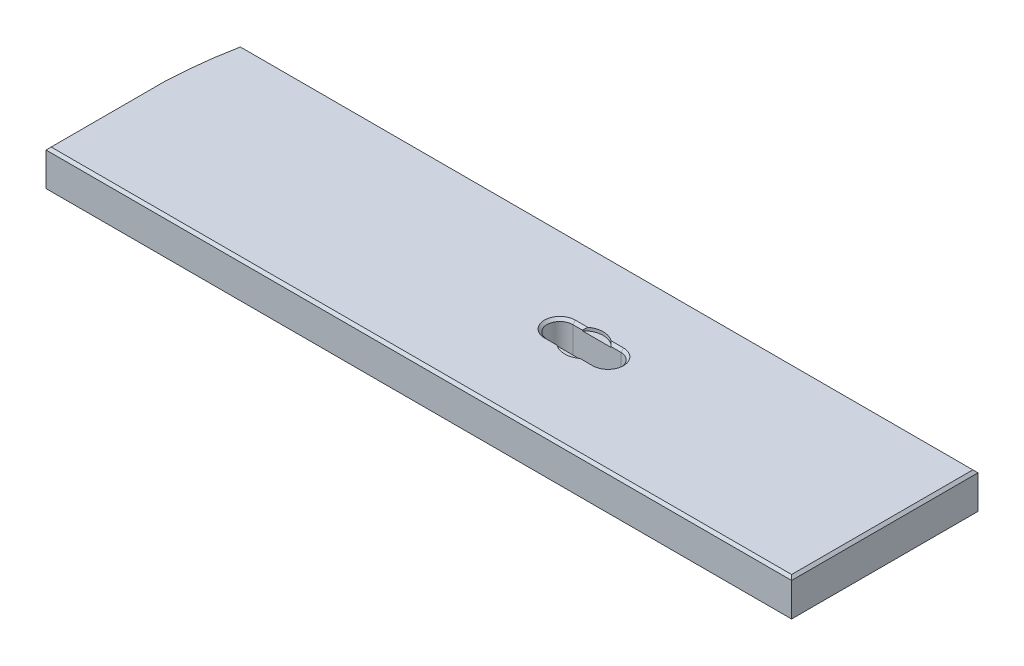
ISO-10303-21;
HEADER;
FILE_DESCRIPTION(('STEP AP214'),'2;1');
FILE_NAME('part.step','',(''),(''),'','','');
FILE_SCHEMA(('AUTOMOTIVE_DESIGN { 1 0 10303 214 1 1 1 1 }'));
ENDSEC;
DATA;
#1=APPLICATION_CONTEXT('core data for automotive mechanical design processes');
#2=APPLICATION_PROTOCOL_DEFINITION('international standard','automotive_design',2000,#1);
#3=PRODUCT_CONTEXT('',#1,'mechanical');
#4=PRODUCT('Part','Part','',(#3));
#5=PRODUCT_RELATED_PRODUCT_CATEGORY('part','',(#4));
#6=PRODUCT_DEFINITION_FORMATION('','',#4);
#7=PRODUCT_DEFINITION_CONTEXT('part definition',#1,'design');
#8=PRODUCT_DEFINITION('design','',#6,#7);
#9=PRODUCT_DEFINITION_SHAPE('','',#8);
#10=(LENGTH_UNIT() NAMED_UNIT(*) SI_UNIT(.MILLI.,.METRE.));
#11=(NAMED_UNIT(*) PLANE_ANGLE_UNIT() SI_UNIT($,.RADIAN.));
#12=(NAMED_UNIT(*) SI_UNIT($,.STERADIAN.) SOLID_ANGLE_UNIT());
#13=UNCERTAINTY_MEASURE_WITH_UNIT(LENGTH_MEASURE(1.E-05),#10,'distance_accuracy_value','');
#14=(GEOMETRIC_REPRESENTATION_CONTEXT(3) GLOBAL_UNCERTAINTY_ASSIGNED_CONTEXT((#13)) GLOBAL_UNIT_ASSIGNED_CONTEXT((#10,
#11,#12)) REPRESENTATION_CONTEXT('',''));
#15=CARTESIAN_POINT('',(0.,0.,0.));
#16=DIRECTION('',(0.,0.,1.));
#17=DIRECTION('',(1.,0.,0.));
#18=AXIS2_PLACEMENT_3D('',#15,#16,#17);
#19=CARTESIAN_POINT('',(409.5623,35.5599999999997,-85.43925));
#20=DIRECTION('',(0.,0.707106781186547,-0.707106781186549));
#21=DIRECTION('',(-1.,0.,0.));
#22=AXIS2_PLACEMENT_3D('',#19,#20,#21);
#23=PLANE('',#22);
#24=CARTESIAN_POINT('',(433.34305,22.8599999999997,-98.13925));
#25=DIRECTION('',(0.,0.707106781186547,-0.707106781186549));
#26=DIRECTION('',(0.,0.707106781186549,0.707106781186547));
#27=AXIS2_PLACEMENT_3D('',#24,#25,#26);
#28=ELLIPSE('',#27,26.9407683632075,19.05);
#29=CARTESIAN_POINT('',(444.77305,38.1,-82.8992499999997));
#30=VERTEX_POINT('',#29);
#31=CARTESIAN_POINT('',(447.542081657124,35.5599999999997,-85.43925));
#32=VERTEX_POINT('',#31);
#33=EDGE_CURVE('E206',#30,#32,#28,.T.);
#34=ORIENTED_EDGE('',*,*,#33,.F.);
#35=DIRECTION('',(-1.,0.,0.));
#36=VECTOR('',#35,1.);
#37=CARTESIAN_POINT('',(409.5623,38.1,-82.8992499999997));
#38=LINE('',#37,#36);
#39=CARTESIAN_POINT('',(457.1238,38.1,-82.8992499999997));
#40=VERTEX_POINT('',#39);
#41=EDGE_CURVE('E218',#40,#30,#38,.T.);
#42=ORIENTED_EDGE('',*,*,#41,.F.);
#43=DIRECTION('',(0.,0.707106781186549,0.707106781186547));
#44=VECTOR('',#43,1.);
#45=CARTESIAN_POINT('',(457.1238,35.5599999999997,-85.43925));
#46=LINE('',#45,#44);
#47=CARTESIAN_POINT('',(457.1238,35.5599999999997,-85.43925));
#48=VERTEX_POINT('',#47);
#49=EDGE_CURVE('E267',#48,#40,#46,.T.);
#50=ORIENTED_EDGE('',*,*,#49,.F.);
#51=DIRECTION('',(1.,0.,0.));
#52=VECTOR('',#51,1.);
#53=CARTESIAN_POINT('',(457.1238,35.5599999999997,-85.43925));
#54=LINE('',#53,#52);
#55=EDGE_CURVE('E220',#32,#48,#54,.T.);
#56=ORIENTED_EDGE('',*,*,#55,.F.);
#57=EDGE_LOOP('',(#34,#42,#50,#56));
#58=FACE_BOUND('',#57,.T.);
#59=ADVANCED_FACE('F41',(#58),#23,.T.);
#60=CARTESIAN_POINT('',(409.5623,35.5599999999997,-110.83925));
#61=DIRECTION('',(0.,0.707106781186547,0.707106781186549));
#62=DIRECTION('',(1.,0.,0.));
#63=AXIS2_PLACEMENT_3D('',#60,#61,#62);
#64=PLANE('',#63);
#65=CARTESIAN_POINT('',(433.34305,22.8599999999997,-98.13925));
#66=DIRECTION('',(0.,0.707106781186547,0.707106781186549));
#67=DIRECTION('',(0.,0.707106781186549,-0.707106781186547));
#68=AXIS2_PLACEMENT_3D('',#65,#66,#67);
#69=ELLIPSE('',#68,26.9407683632075,19.05);
#70=CARTESIAN_POINT('',(421.91305,38.1,-113.37925));
#71=VERTEX_POINT('',#70);
#72=CARTESIAN_POINT('',(419.144018342876,35.5599999999997,-110.83925));
#73=VERTEX_POINT('',#72);
#74=EDGE_CURVE('E50',#71,#73,#69,.T.);
#75=ORIENTED_EDGE('',*,*,#74,.F.);
#76=DIRECTION('',(1.,0.,0.));
#77=VECTOR('',#76,1.);
#78=CARTESIAN_POINT('',(457.1238,38.1,-113.37925));
#79=LINE('',#78,#77);
#80=CARTESIAN_POINT('',(409.5623,38.1,-113.37925));
#81=VERTEX_POINT('',#80);
#82=EDGE_CURVE('E235',#81,#71,#79,.T.);
#83=ORIENTED_EDGE('',*,*,#82,.F.);
#84=DIRECTION('',(0.,-0.707106781186549,0.707106781186547));
#85=VECTOR('',#84,1.);
#86=CARTESIAN_POINT('',(409.5623,38.1,-113.37925));
#87=LINE('',#86,#85);
#88=CARTESIAN_POINT('',(409.5623,35.5599999999997,-110.83925));
#89=VERTEX_POINT('',#88);
#90=EDGE_CURVE('E257',#81,#89,#87,.T.);
#91=ORIENTED_EDGE('',*,*,#90,.T.);
#92=DIRECTION('',(-1.,0.,0.));
#93=VECTOR('',#92,1.);
#94=CARTESIAN_POINT('',(409.5623,35.5599999999997,-110.83925));
#95=LINE('',#94,#93);
#96=EDGE_CURVE('E459',#73,#89,#95,.T.);
#97=ORIENTED_EDGE('',*,*,#96,.F.);
#98=EDGE_LOOP('',(#75,#83,#91,#97));
#99=FACE_BOUND('',#98,.T.);
#100=ADVANCED_FACE('F400',(#99),#64,.T.);
#101=CARTESIAN_POINT('',(0.,38.1,0.));
#102=DIRECTION('',(0.,-1.,0.));
#103=DIRECTION('',(0.,0.,-1.));
#104=AXIS2_PLACEMENT_3D('',#101,#102,#103);
#105=PLANE('',#104);
#106=ORIENTED_EDGE('',*,*,#41,.T.);
#107=CARTESIAN_POINT('',(433.34305,38.1,-98.13925));
#108=DIRECTION('',(0.,1.,0.));
#109=DIRECTION('',(0.,0.,1.));
#110=AXIS2_PLACEMENT_3D('',#107,#108,#109);
#111=CIRCLE('',#110,19.05);
#112=CARTESIAN_POINT('',(421.91305,38.1,-82.8992499999997));
#113=VERTEX_POINT('',#112);
#114=EDGE_CURVE('E203',#113,#30,#111,.T.);
#115=ORIENTED_EDGE('',*,*,#114,.F.);
#116=CARTESIAN_POINT('',(409.5623,38.1,-82.8992499999997));
#117=VERTEX_POINT('',#116);
#118=EDGE_CURVE('E228',#113,#117,#38,.T.);
#119=ORIENTED_EDGE('',*,*,#118,.T.);
#120=CARTESIAN_POINT('',(409.5623,38.1,-98.13925));
#121=DIRECTION('',(0.,-1.,0.));
#122=DIRECTION('',(0.,0.,-1.));
#123=AXIS2_PLACEMENT_3D('',#120,#121,#122);
#124=CIRCLE('',#123,15.2400000000003);
#125=EDGE_CURVE('E227',#117,#81,#124,.T.);
#126=ORIENTED_EDGE('',*,*,#125,.T.);
#127=ORIENTED_EDGE('',*,*,#82,.T.);
#128=CARTESIAN_POINT('',(444.77305,38.1,-113.37925));
#129=VERTEX_POINT('',#128);
#130=EDGE_CURVE('E212',#129,#71,#111,.T.);
#131=ORIENTED_EDGE('',*,*,#130,.F.);
#132=CARTESIAN_POINT('',(457.1238,38.1,-113.37925));
#133=VERTEX_POINT('',#132);
#134=EDGE_CURVE('E230',#129,#133,#79,.T.);
#135=ORIENTED_EDGE('',*,*,#134,.T.);
#136=CARTESIAN_POINT('',(457.1238,38.1,-98.13925));
#137=DIRECTION('',(0.,-1.,0.));
#138=DIRECTION('',(0.,0.,-1.));
#139=AXIS2_PLACEMENT_3D('',#136,#137,#138);
#140=CIRCLE('',#139,15.2400000000003);
#141=EDGE_CURVE('E226',#133,#40,#140,.T.);
#142=ORIENTED_EDGE('',*,*,#141,.T.);
#143=EDGE_LOOP('',(#106,#115,#119,#126,#127,#131,#135,#142));
#144=FACE_BOUND('',#143,.T.);
#145=DIRECTION('',(1.,0.,0.));
#146=VECTOR('',#145,1.);
#147=CARTESIAN_POINT('',(0.,38.1,-2.53999999999999));
#148=LINE('',#147,#146);
#149=CARTESIAN_POINT('',(2.53999999999999,38.1,-2.53999999999999));
#150=VERTEX_POINT('',#149);
#151=CARTESIAN_POINT('',(734.06,38.1,-2.53999999999999));
#152=VERTEX_POINT('',#151);
#153=EDGE_CURVE('E469',#150,#152,#148,.T.);
#154=ORIENTED_EDGE('',*,*,#153,.T.);
#155=DIRECTION('',(0.,0.,-1.));
#156=VECTOR('',#155,1.);
#157=CARTESIAN_POINT('',(734.06,38.1,0.));
#158=LINE('',#157,#156);
#159=CARTESIAN_POINT('',(734.06,38.1,-181.61));
#160=VERTEX_POINT('',#159);
#161=EDGE_CURVE('E470',#152,#160,#158,.T.);
#162=ORIENTED_EDGE('',*,*,#161,.T.);
#163=DIRECTION('',(-1.,0.,0.));
#164=VECTOR('',#163,1.);
#165=CARTESIAN_POINT('',(0.,38.1,-181.61));
#166=LINE('',#165,#164);
#167=CARTESIAN_POINT('',(10.4252796954768,38.1,-181.61));
#168=VERTEX_POINT('',#167);
#169=EDGE_CURVE('E463',#160,#168,#166,.T.);
#170=ORIENTED_EDGE('',*,*,#169,.T.);
#171=CARTESIAN_POINT('',(433.323999999998,38.1,-98.0439999999572));
#172=DIRECTION('',(0.,-1.,0.));
#173=DIRECTION('',(0.,0.,-1.));
#174=AXIS2_PLACEMENT_3D('',#171,#172,#173);
#175=CIRCLE('',#174,431.076099999999);
#176=CARTESIAN_POINT('',(2.53999999999999,38.1,-113.91061070327));
#177=VERTEX_POINT('',#176);
#178=EDGE_CURVE('E465',#168,#177,#175,.F.);
#179=ORIENTED_EDGE('',*,*,#178,.T.);
#180=DIRECTION('',(0.,0.,1.));
#181=VECTOR('',#180,1.);
#182=CARTESIAN_POINT('',(2.53999999999999,38.1,0.));
#183=LINE('',#182,#181);
#184=EDGE_CURVE('E467',#177,#150,#183,.T.);
#185=ORIENTED_EDGE('',*,*,#184,.T.);
#186=EDGE_LOOP('',(#154,#162,#170,#179,#185));
#187=FACE_BOUND('',#186,.T.);
#188=ADVANCED_FACE('F223',(#144,#187),#105,.F.);
#189=CARTESIAN_POINT('',(0.,0.,0.));
#190=DIRECTION('',(0.,-1.,0.));
#191=DIRECTION('',(0.,0.,-1.));
#192=AXIS2_PLACEMENT_3D('',#189,#190,#191);
#193=PLANE('',#192);
#194=DIRECTION('',(-1.,0.,0.));
#195=VECTOR('',#194,1.);
#196=CARTESIAN_POINT('',(0.,0.,-113.37925));
#197=LINE('',#196,#195);
#198=CARTESIAN_POINT('',(457.1238,0.,-113.37925));
#199=VERTEX_POINT('',#198);
#200=CARTESIAN_POINT('',(409.5623,0.,-113.37925));
#201=VERTEX_POINT('',#200);
#202=EDGE_CURVE('E558',#199,#201,#197,.T.);
#203=ORIENTED_EDGE('',*,*,#202,.T.);
#204=CARTESIAN_POINT('',(409.5623,0.,-98.13925));
#205=DIRECTION('',(0.,-1.,0.));
#206=DIRECTION('',(0.,0.,-1.));
#207=AXIS2_PLACEMENT_3D('',#204,#205,#206);
#208=CIRCLE('',#207,15.24);
#209=CARTESIAN_POINT('',(409.5623,0.,-82.89925));
#210=VERTEX_POINT('',#209);
#211=EDGE_CURVE('E560',#201,#210,#208,.F.);
#212=ORIENTED_EDGE('',*,*,#211,.T.);
#213=DIRECTION('',(1.,0.,0.));
#214=VECTOR('',#213,1.);
#215=CARTESIAN_POINT('',(0.,0.,-82.89925));
#216=LINE('',#215,#214);
#217=CARTESIAN_POINT('',(457.1238,0.,-82.89925));
#218=VERTEX_POINT('',#217);
#219=EDGE_CURVE('E545',#210,#218,#216,.T.);
#220=ORIENTED_EDGE('',*,*,#219,.T.);
#221=CARTESIAN_POINT('',(457.1238,0.,-98.13925));
#222=DIRECTION('',(0.,-1.,0.));
#223=DIRECTION('',(0.,0.,-1.));
#224=AXIS2_PLACEMENT_3D('',#221,#222,#223);
#225=CIRCLE('',#224,15.24);
#226=EDGE_CURVE('E556',#218,#199,#225,.F.);
#227=ORIENTED_EDGE('',*,*,#226,.T.);
#228=EDGE_LOOP('',(#203,#212,#220,#227));
#229=FACE_BOUND('',#228,.T.);
#230=DIRECTION('',(-1.,0.,0.));
#231=VECTOR('',#230,1.);
#232=CARTESIAN_POINT('',(0.,0.,-2.5400000000004));
#233=LINE('',#232,#231);
#234=CARTESIAN_POINT('',(734.06,0.,-2.5400000000004));
#235=VERTEX_POINT('',#234);
#236=CARTESIAN_POINT('',(2.5400000000004,0.,-2.5400000000004));
#237=VERTEX_POINT('',#236);
#238=EDGE_CURVE('E546',#235,#237,#233,.T.);
#239=ORIENTED_EDGE('',*,*,#238,.T.);
#240=DIRECTION('',(0.,0.,-1.));
#241=VECTOR('',#240,1.);
#242=CARTESIAN_POINT('',(2.5400000000004,0.,-113.957302712168));
#243=LINE('',#242,#241);
#244=CARTESIAN_POINT('',(2.5400000000004,0.,-113.91061070327));
#245=VERTEX_POINT('',#244);
#246=EDGE_CURVE('E543',#237,#245,#243,.T.);
#247=ORIENTED_EDGE('',*,*,#246,.T.);
#248=CARTESIAN_POINT('',(433.323999999998,0.,-98.0439999999572));
#249=DIRECTION('',(0.,-1.,0.));
#250=DIRECTION('',(0.,0.,-1.));
#251=AXIS2_PLACEMENT_3D('',#248,#249,#250);
#252=CIRCLE('',#251,431.076099999999);
#253=CARTESIAN_POINT('',(10.4252796954771,0.,-181.61));
#254=VERTEX_POINT('',#253);
#255=EDGE_CURVE('E256',#245,#254,#252,.T.);
#256=ORIENTED_EDGE('',*,*,#255,.T.);
#257=DIRECTION('',(1.,0.,0.));
#258=VECTOR('',#257,1.);
#259=CARTESIAN_POINT('',(736.6,0.,-181.61));
#260=LINE('',#259,#258);
#261=CARTESIAN_POINT('',(734.06,0.,-181.61));
#262=VERTEX_POINT('',#261);
#263=EDGE_CURVE('E552',#254,#262,#260,.T.);
#264=ORIENTED_EDGE('',*,*,#263,.T.);
#265=DIRECTION('',(0.,0.,1.));
#266=VECTOR('',#265,1.);
#267=CARTESIAN_POINT('',(734.06,0.,0.));
#268=LINE('',#267,#266);
#269=EDGE_CURVE('E550',#262,#235,#268,.T.);
#270=ORIENTED_EDGE('',*,*,#269,.T.);
#271=EDGE_LOOP('',(#239,#247,#256,#264,#270));
#272=FACE_BOUND('',#271,.T.);
#273=ADVANCED_FACE('F631',(#229,#272),#193,.T.);
#274=CARTESIAN_POINT('',(0.,38.1,0.));
#275=DIRECTION('',(1.,0.,0.));
#276=DIRECTION('',(0.,0.,-1.));
#277=AXIS2_PLACEMENT_3D('',#274,#275,#276);
#278=PLANE('',#277);
#279=DIRECTION('',(0.,-1.,0.));
#280=VECTOR('',#279,1.);
#281=CARTESIAN_POINT('',(0.,38.1,-113.957302712168));
#282=LINE('',#281,#280);
#283=CARTESIAN_POINT('',(0.,35.56,-113.957302712168));
#284=VERTEX_POINT('',#283);
#285=CARTESIAN_POINT('',(0.,2.54000000000039,-113.957302712168));
#286=VERTEX_POINT('',#285);
#287=EDGE_CURVE('E269',#284,#286,#282,.T.);
#288=ORIENTED_EDGE('',*,*,#287,.T.);
#289=DIRECTION('',(0.,0.,1.));
#290=VECTOR('',#289,1.);
#291=CARTESIAN_POINT('',(0.,2.54000000000038,0.));
#292=LINE('',#291,#290);
#293=CARTESIAN_POINT('',(0.,2.54000000000039,0.));
#294=VERTEX_POINT('',#293);
#295=EDGE_CURVE('E504',#286,#294,#292,.T.);
#296=ORIENTED_EDGE('',*,*,#295,.T.);
#297=DIRECTION('',(0.,-1.,0.));
#298=VECTOR('',#297,1.);
#299=CARTESIAN_POINT('',(0.,38.1,0.));
#300=LINE('',#299,#298);
#301=CARTESIAN_POINT('',(0.,35.56,0.));
#302=VERTEX_POINT('',#301);
#303=EDGE_CURVE('E456',#302,#294,#300,.T.);
#304=ORIENTED_EDGE('',*,*,#303,.F.);
#305=DIRECTION('',(0.,0.,-1.));
#306=VECTOR('',#305,1.);
#307=CARTESIAN_POINT('',(0.,35.56,0.));
#308=LINE('',#307,#306);
#309=EDGE_CURVE('E250',#302,#284,#308,.T.);
#310=ORIENTED_EDGE('',*,*,#309,.T.);
#311=EDGE_LOOP('',(#288,#296,#304,#310));
#312=FACE_BOUND('',#311,.T.);
#313=ADVANCED_FACE('F539',(#312),#278,.F.);
#314=CARTESIAN_POINT('',(0.,38.1,0.));
#315=DIRECTION('',(0.,0.,-1.));
#316=DIRECTION('',(-1.,0.,0.));
#317=AXIS2_PLACEMENT_3D('',#314,#315,#316);
#318=PLANE('',#317);
#319=ORIENTED_EDGE('',*,*,#303,.T.);
#320=DIRECTION('',(1.,0.,0.));
#321=VECTOR('',#320,1.);
#322=CARTESIAN_POINT('',(736.6,2.54000000000038,0.));
#323=LINE('',#322,#321);
#324=CARTESIAN_POINT('',(736.6,2.54000000000039,0.));
#325=VERTEX_POINT('',#324);
#326=EDGE_CURVE('E500',#294,#325,#323,.T.);
#327=ORIENTED_EDGE('',*,*,#326,.T.);
#328=DIRECTION('',(0.,-1.,0.));
#329=VECTOR('',#328,1.);
#330=CARTESIAN_POINT('',(736.6,38.1,0.));
#331=LINE('',#330,#329);
#332=CARTESIAN_POINT('',(736.6,35.56,0.));
#333=VERTEX_POINT('',#332);
#334=EDGE_CURVE('E453',#333,#325,#331,.T.);
#335=ORIENTED_EDGE('',*,*,#334,.F.);
#336=DIRECTION('',(-1.,0.,0.));
#337=VECTOR('',#336,1.);
#338=CARTESIAN_POINT('',(0.,35.56,0.));
#339=LINE('',#338,#337);
#340=EDGE_CURVE('E248',#333,#302,#339,.T.);
#341=ORIENTED_EDGE('',*,*,#340,.T.);
#342=EDGE_LOOP('',(#319,#327,#335,#341));
#343=FACE_BOUND('',#342,.T.);
#344=ADVANCED_FACE('F498',(#343),#318,.F.);
#345=CARTESIAN_POINT('',(736.6,38.1,0.));
#346=DIRECTION('',(-1.,0.,0.));
#347=DIRECTION('',(0.,0.,1.));
#348=AXIS2_PLACEMENT_3D('',#345,#346,#347);
#349=PLANE('',#348);
#350=ORIENTED_EDGE('',*,*,#334,.T.);
#351=DIRECTION('',(0.,0.,-1.));
#352=VECTOR('',#351,1.);
#353=CARTESIAN_POINT('',(736.6,2.54000000000038,-184.15));
#354=LINE('',#353,#352);
#355=CARTESIAN_POINT('',(736.6,2.54000000000039,-184.15));
#356=VERTEX_POINT('',#355);
#357=EDGE_CURVE('E503',#325,#356,#354,.T.);
#358=ORIENTED_EDGE('',*,*,#357,.T.);
#359=DIRECTION('',(0.,-1.,0.));
#360=VECTOR('',#359,1.);
#361=CARTESIAN_POINT('',(736.6,38.1,-184.15));
#362=LINE('',#361,#360);
#363=CARTESIAN_POINT('',(736.6,35.56,-184.15));
#364=VERTEX_POINT('',#363);
#365=EDGE_CURVE('E450',#364,#356,#362,.T.);
#366=ORIENTED_EDGE('',*,*,#365,.F.);
#367=DIRECTION('',(0.,0.,1.));
#368=VECTOR('',#367,1.);
#369=CARTESIAN_POINT('',(736.6,35.56,0.));
#370=LINE('',#369,#368);
#371=EDGE_CURVE('E245',#364,#333,#370,.T.);
#372=ORIENTED_EDGE('',*,*,#371,.T.);
#373=EDGE_LOOP('',(#350,#358,#366,#372));
#374=FACE_BOUND('',#373,.T.);
#375=ADVANCED_FACE('F496',(#374),#349,.F.);
#376=CARTESIAN_POINT('',(0.,38.1,-184.15));
#377=DIRECTION('',(0.,0.,1.));
#378=DIRECTION('',(1.,0.,0.));
#379=AXIS2_PLACEMENT_3D('',#376,#377,#378);
#380=PLANE('',#379);
#381=ORIENTED_EDGE('',*,*,#365,.T.);
#382=DIRECTION('',(-1.,0.,0.));
#383=VECTOR('',#382,1.);
#384=CARTESIAN_POINT('',(8.34320167705943,2.54000000000038,-184.15));
#385=LINE('',#384,#383);
#386=CARTESIAN_POINT('',(8.34320167705943,2.54000000000039,-184.149999999995));
#387=VERTEX_POINT('',#386);
#388=EDGE_CURVE('E506',#356,#387,#385,.T.);
#389=ORIENTED_EDGE('',*,*,#388,.T.);
#390=DIRECTION('',(0.,-1.,0.));
#391=VECTOR('',#390,1.);
#392=CARTESIAN_POINT('',(8.34320167705943,38.1,-184.149999999995));
#393=LINE('',#392,#391);
#394=CARTESIAN_POINT('',(8.34320167705943,35.56,-184.149999999995));
#395=VERTEX_POINT('',#394);
#396=EDGE_CURVE('E444',#395,#387,#393,.T.);
#397=ORIENTED_EDGE('',*,*,#396,.F.);
#398=DIRECTION('',(1.,0.,0.));
#399=VECTOR('',#398,1.);
#400=CARTESIAN_POINT('',(0.,35.56,-184.15));
#401=LINE('',#400,#399);
#402=EDGE_CURVE('E254',#395,#364,#401,.T.);
#403=ORIENTED_EDGE('',*,*,#402,.T.);
#404=EDGE_LOOP('',(#381,#389,#397,#403));
#405=FACE_BOUND('',#404,.T.);
#406=ADVANCED_FACE('F628',(#405),#380,.F.);
#407=CARTESIAN_POINT('',(457.1238,38.1,-98.13925));
#408=DIRECTION('',(0.,-1.,0.));
#409=DIRECTION('',(0.,0.,-1.));
#410=AXIS2_PLACEMENT_3D('',#407,#408,#409);
#411=CYLINDRICAL_SURFACE('',#410,12.7);
#412=DIRECTION('',(0.,-1.,0.));
#413=VECTOR('',#412,1.);
#414=CARTESIAN_POINT('',(457.1238,38.1,-110.83925));
#415=LINE('',#414,#413);
#416=CARTESIAN_POINT('',(457.1238,35.5599999999997,-110.83925));
#417=VERTEX_POINT('',#416);
#418=CARTESIAN_POINT('',(457.1238,2.54,-110.83925));
#419=VERTEX_POINT('',#418);
#420=EDGE_CURVE('E442',#417,#419,#415,.T.);
#421=ORIENTED_EDGE('',*,*,#420,.T.);
#422=CARTESIAN_POINT('',(457.1238,2.53999999999999,-98.13925));
#423=DIRECTION('',(0.,-1.,0.));
#424=DIRECTION('',(0.,0.,-1.));
#425=AXIS2_PLACEMENT_3D('',#422,#423,#424);
#426=CIRCLE('',#425,12.7);
#427=CARTESIAN_POINT('',(457.1238,2.54,-85.43925));
#428=VERTEX_POINT('',#427);
#429=EDGE_CURVE('E567',#419,#428,#426,.T.);
#430=ORIENTED_EDGE('',*,*,#429,.T.);
#431=DIRECTION('',(0.,-1.,0.));
#432=VECTOR('',#431,1.);
#433=CARTESIAN_POINT('',(457.1238,38.1,-85.43925));
#434=LINE('',#433,#432);
#435=EDGE_CURVE('E439',#48,#428,#434,.T.);
#436=ORIENTED_EDGE('',*,*,#435,.F.);
#437=CARTESIAN_POINT('',(457.1238,35.5599999999997,-98.13925));
#438=DIRECTION('',(0.,-1.,0.));
#439=DIRECTION('',(0.,0.,-1.));
#440=AXIS2_PLACEMENT_3D('',#437,#438,#439);
#441=CIRCLE('',#440,12.7);
#442=EDGE_CURVE('E243',#48,#417,#441,.F.);
#443=ORIENTED_EDGE('',*,*,#442,.T.);
#444=EDGE_LOOP('',(#421,#430,#436,#443));
#445=FACE_BOUND('',#444,.T.);
#446=ADVANCED_FACE('F571',(#445),#411,.F.);
#447=CARTESIAN_POINT('',(409.5623,38.1,-110.83925));
#448=DIRECTION('',(0.,0.,1.));
#449=DIRECTION('',(1.,0.,0.));
#450=AXIS2_PLACEMENT_3D('',#447,#448,#449);
#451=PLANE('',#450);
#452=DIRECTION('',(0.,1.,0.));
#453=VECTOR('',#452,1.);
#454=CARTESIAN_POINT('',(447.542081657124,34.925,-110.83925));
#455=LINE('',#454,#453);
#456=CARTESIAN_POINT('',(447.542081657124,34.925,-110.83925));
#457=VERTEX_POINT('',#456);
#458=CARTESIAN_POINT('',(447.542081657124,35.5599999999997,-110.83925));
#459=VERTEX_POINT('',#458);
#460=EDGE_CURVE('E65',#457,#459,#455,.T.);
#461=ORIENTED_EDGE('',*,*,#460,.F.);
#462=DIRECTION('',(-1.,0.,0.));
#463=VECTOR('',#462,1.);
#464=CARTESIAN_POINT('',(409.5623,34.925,-110.83925));
#465=LINE('',#464,#463);
#466=CARTESIAN_POINT('',(419.144018342876,34.925,-110.83925));
#467=VERTEX_POINT('',#466);
#468=EDGE_CURVE('E524',#457,#467,#465,.T.);
#469=ORIENTED_EDGE('',*,*,#468,.T.);
#470=DIRECTION('',(0.,1.,0.));
#471=VECTOR('',#470,1.);
#472=CARTESIAN_POINT('',(419.144018342876,34.925,-110.83925));
#473=LINE('',#472,#471);
#474=EDGE_CURVE('E427',#73,#467,#473,.F.);
#475=ORIENTED_EDGE('',*,*,#474,.F.);
#476=ORIENTED_EDGE('',*,*,#96,.T.);
#477=DIRECTION('',(0.,-1.,0.));
#478=VECTOR('',#477,1.);
#479=CARTESIAN_POINT('',(409.5623,38.1,-110.83925));
#480=LINE('',#479,#478);
#481=CARTESIAN_POINT('',(409.5623,2.54,-110.83925));
#482=VERTEX_POINT('',#481);
#483=EDGE_CURVE('E438',#89,#482,#480,.T.);
#484=ORIENTED_EDGE('',*,*,#483,.T.);
#485=DIRECTION('',(1.,0.,0.));
#486=VECTOR('',#485,1.);
#487=CARTESIAN_POINT('',(409.5623,2.53999999999999,-110.83925));
#488=LINE('',#487,#486);
#489=EDGE_CURVE('E565',#482,#419,#488,.T.);
#490=ORIENTED_EDGE('',*,*,#489,.T.);
#491=ORIENTED_EDGE('',*,*,#420,.F.);
#492=EDGE_CURVE('E460',#417,#459,#95,.T.);
#493=ORIENTED_EDGE('',*,*,#492,.T.);
#494=EDGE_LOOP('',(#461,#469,#475,#476,#484,#490,#491,#493));
#495=FACE_BOUND('',#494,.T.);
#496=ADVANCED_FACE('F583',(#495),#451,.T.);
#497=CARTESIAN_POINT('',(409.5623,38.1,-98.13925));
#498=DIRECTION('',(0.,-1.,0.));
#499=DIRECTION('',(0.,0.,-1.));
#500=AXIS2_PLACEMENT_3D('',#497,#498,#499);
#501=CYLINDRICAL_SURFACE('',#500,12.7);
#502=DIRECTION('',(0.,-1.,0.));
#503=VECTOR('',#502,1.);
#504=CARTESIAN_POINT('',(409.5623,38.1,-85.43925));
#505=LINE('',#504,#503);
#506=CARTESIAN_POINT('',(409.5623,35.5599999999997,-85.43925));
#507=VERTEX_POINT('',#506);
#508=CARTESIAN_POINT('',(409.5623,2.54,-85.43925));
#509=VERTEX_POINT('',#508);
#510=EDGE_CURVE('E431',#507,#509,#505,.T.);
#511=ORIENTED_EDGE('',*,*,#510,.T.);
#512=CARTESIAN_POINT('',(409.5623,2.53999999999999,-98.13925));
#513=DIRECTION('',(0.,-1.,0.));
#514=DIRECTION('',(0.,0.,-1.));
#515=AXIS2_PLACEMENT_3D('',#512,#513,#514);
#516=CIRCLE('',#515,12.7);
#517=EDGE_CURVE('E563',#509,#482,#516,.T.);
#518=ORIENTED_EDGE('',*,*,#517,.T.);
#519=ORIENTED_EDGE('',*,*,#483,.F.);
#520=CARTESIAN_POINT('',(409.5623,35.5599999999997,-98.13925));
#521=DIRECTION('',(0.,-1.,0.));
#522=DIRECTION('',(0.,0.,-1.));
#523=AXIS2_PLACEMENT_3D('',#520,#521,#522);
#524=CIRCLE('',#523,12.7);
#525=EDGE_CURVE('E238',#89,#507,#524,.F.);
#526=ORIENTED_EDGE('',*,*,#525,.T.);
#527=EDGE_LOOP('',(#511,#518,#519,#526));
#528=FACE_BOUND('',#527,.T.);
#529=ADVANCED_FACE('F582',(#528),#501,.F.);
#530=CARTESIAN_POINT('',(409.5623,38.1,-85.43925));
#531=DIRECTION('',(0.,0.,-1.));
#532=DIRECTION('',(-1.,0.,0.));
#533=AXIS2_PLACEMENT_3D('',#530,#531,#532);
#534=PLANE('',#533);
#535=DIRECTION('',(0.,1.,0.));
#536=VECTOR('',#535,1.);
#537=CARTESIAN_POINT('',(419.144018342876,34.925,-85.43925));
#538=LINE('',#537,#536);
#539=CARTESIAN_POINT('',(419.144018342876,34.925,-85.43925));
#540=VERTEX_POINT('',#539);
#541=CARTESIAN_POINT('',(419.144018342876,35.5599999999997,-85.43925));
#542=VERTEX_POINT('',#541);
#543=EDGE_CURVE('E57',#540,#542,#538,.T.);
#544=ORIENTED_EDGE('',*,*,#543,.F.);
#545=DIRECTION('',(1.,0.,0.));
#546=VECTOR('',#545,1.);
#547=CARTESIAN_POINT('',(409.5623,34.925,-85.43925));
#548=LINE('',#547,#546);
#549=CARTESIAN_POINT('',(447.542081657124,34.925,-85.43925));
#550=VERTEX_POINT('',#549);
#551=EDGE_CURVE('E11',#540,#550,#548,.T.);
#552=ORIENTED_EDGE('',*,*,#551,.T.);
#553=DIRECTION('',(0.,1.,0.));
#554=VECTOR('',#553,1.);
#555=CARTESIAN_POINT('',(447.542081657124,34.925,-85.43925));
#556=LINE('',#555,#554);
#557=EDGE_CURVE('E221',#32,#550,#556,.F.);
#558=ORIENTED_EDGE('',*,*,#557,.F.);
#559=ORIENTED_EDGE('',*,*,#55,.T.);
#560=ORIENTED_EDGE('',*,*,#435,.T.);
#561=DIRECTION('',(-1.,0.,0.));
#562=VECTOR('',#561,1.);
#563=CARTESIAN_POINT('',(409.5623,2.53999999999999,-85.43925));
#564=LINE('',#563,#562);
#565=EDGE_CURVE('E434',#428,#509,#564,.T.);
#566=ORIENTED_EDGE('',*,*,#565,.T.);
#567=ORIENTED_EDGE('',*,*,#510,.F.);
#568=EDGE_CURVE('E240',#507,#542,#54,.T.);
#569=ORIENTED_EDGE('',*,*,#568,.T.);
#570=EDGE_LOOP('',(#544,#552,#558,#559,#560,#566,#567,#569));
#571=FACE_BOUND('',#570,.T.);
#572=ADVANCED_FACE('F422',(#571),#534,.T.);
#573=CARTESIAN_POINT('',(433.323999999998,38.1,-98.0439999999572));
#574=DIRECTION('',(0.,-1.,0.));
#575=DIRECTION('',(0.,0.,-1.));
#576=AXIS2_PLACEMENT_3D('',#573,#574,#575);
#577=CYLINDRICAL_SURFACE('',#576,433.616099999999);
#578=ORIENTED_EDGE('',*,*,#396,.T.);
#579=CARTESIAN_POINT('',(433.323999999998,2.54000000000038,-98.0439999999572));
#580=DIRECTION('',(0.,-1.,0.));
#581=DIRECTION('',(0.,0.,-1.));
#582=AXIS2_PLACEMENT_3D('',#579,#580,#581);
#583=CIRCLE('',#582,433.616099999999);
#584=EDGE_CURVE('E512',#387,#286,#583,.F.);
#585=ORIENTED_EDGE('',*,*,#584,.T.);
#586=ORIENTED_EDGE('',*,*,#287,.F.);
#587=CARTESIAN_POINT('',(433.323999999998,35.56,-98.0439999999572));
#588=DIRECTION('',(0.,-1.,0.));
#589=DIRECTION('',(0.,0.,-1.));
#590=AXIS2_PLACEMENT_3D('',#587,#588,#589);
#591=CIRCLE('',#590,433.616099999999);
#592=EDGE_CURVE('E252',#284,#395,#591,.T.);
#593=ORIENTED_EDGE('',*,*,#592,.T.);
#594=EDGE_LOOP('',(#578,#585,#586,#593));
#595=FACE_BOUND('',#594,.T.);
#596=ADVANCED_FACE('F412',(#595),#577,.T.);
#597=EDGE_CURVE('E208',#542,#113,#28,.T.);
#598=ORIENTED_EDGE('',*,*,#597,.F.);
#599=ORIENTED_EDGE('',*,*,#568,.F.);
#600=DIRECTION('',(0.,-0.707106781186549,-0.707106781186547));
#601=VECTOR('',#600,1.);
#602=CARTESIAN_POINT('',(409.5623,38.1,-82.8992499999997));
#603=LINE('',#602,#601);
#604=EDGE_CURVE('E264',#117,#507,#603,.T.);
#605=ORIENTED_EDGE('',*,*,#604,.F.);
#606=ORIENTED_EDGE('',*,*,#118,.F.);
#607=EDGE_LOOP('',(#598,#599,#605,#606));
#608=FACE_BOUND('',#607,.T.);
#609=ADVANCED_FACE('F402',(#608),#23,.T.);
#610=CARTESIAN_POINT('',(457.1238,35.5599999999997,-98.13925));
#611=DIRECTION('',(0.,1.,0.));
#612=DIRECTION('',(0.,0.,1.));
#613=AXIS2_PLACEMENT_3D('',#610,#611,#612);
#614=CONICAL_SURFACE('',#613,12.7,0.785398163397447);
#615=ORIENTED_EDGE('',*,*,#49,.T.);
#616=ORIENTED_EDGE('',*,*,#141,.F.);
#617=DIRECTION('',(0.,0.707106781186549,-0.707106781186547));
#618=VECTOR('',#617,1.);
#619=CARTESIAN_POINT('',(457.1238,35.5599999999997,-110.83925));
#620=LINE('',#619,#618);
#621=EDGE_CURVE('E260',#417,#133,#620,.T.);
#622=ORIENTED_EDGE('',*,*,#621,.F.);
#623=ORIENTED_EDGE('',*,*,#442,.F.);
#624=EDGE_LOOP('',(#615,#616,#622,#623));
#625=FACE_BOUND('',#624,.T.);
#626=ADVANCED_FACE('F411',(#625),#614,.F.);
#627=CARTESIAN_POINT('',(409.5623,35.5599999999997,-98.13925));
#628=DIRECTION('',(0.,1.,0.));
#629=DIRECTION('',(0.,0.,1.));
#630=AXIS2_PLACEMENT_3D('',#627,#628,#629);
#631=CONICAL_SURFACE('',#630,12.7,0.785398163397447);
#632=ORIENTED_EDGE('',*,*,#604,.T.);
#633=ORIENTED_EDGE('',*,*,#525,.F.);
#634=ORIENTED_EDGE('',*,*,#90,.F.);
#635=ORIENTED_EDGE('',*,*,#125,.F.);
#636=EDGE_LOOP('',(#632,#633,#634,#635));
#637=FACE_BOUND('',#636,.T.);
#638=ADVANCED_FACE('F419',(#637),#631,.F.);
#639=EDGE_CURVE('E514',#459,#129,#69,.T.);
#640=ORIENTED_EDGE('',*,*,#639,.F.);
#641=ORIENTED_EDGE('',*,*,#492,.F.);
#642=ORIENTED_EDGE('',*,*,#621,.T.);
#643=ORIENTED_EDGE('',*,*,#134,.F.);
#644=EDGE_LOOP('',(#640,#641,#642,#643));
#645=FACE_BOUND('',#644,.T.);
#646=ADVANCED_FACE('F317',(#645),#64,.T.);
#647=CARTESIAN_POINT('',(2.53999999999999,38.1,0.));
#648=DIRECTION('',(0.707106781186548,-0.707106781186547,0.));
#649=DIRECTION('',(0.,0.,1.));
#650=AXIS2_PLACEMENT_3D('',#647,#648,#649);
#651=PLANE('',#650);
#652=DIRECTION('',(0.577350269189626,0.577350269189626,-0.577350269189626));
#653=VECTOR('',#652,1.);
#654=CARTESIAN_POINT('',(1.69333333333332,37.2533333333333,-1.69333333333332));
#655=LINE('',#654,#653);
#656=EDGE_CURVE('E284',#150,#302,#655,.F.);
#657=ORIENTED_EDGE('',*,*,#656,.F.);
#658=ORIENTED_EDGE('',*,*,#184,.F.);
#659=CARTESIAN_POINT('',(0.,35.56,-113.957302712168));
#660=CARTESIAN_POINT('',(0.423333438405127,35.9833334384051,-113.949532142305));
#661=CARTESIAN_POINT('',(0.846666824274298,36.4066668242743,-113.941755856632));
#662=CARTESIAN_POINT('',(1.69333349094095,37.253333490941,-113.926191853665));
#663=CARTESIAN_POINT('',(2.11666677173844,37.6766667717385,-113.918404136371));
#664=CARTESIAN_POINT('',(2.53999999999997,38.1,-113.910610703268));
#665=B_SPLINE_CURVE_WITH_KNOTS('',3,(#659,#660,#661,#662,#663,#664),.UNSPECIFIED.,.F.,.F.,(4,2,
4),(0.,1.79620294961791,3.59240589923677),.UNSPECIFIED.);
#666=EDGE_CURVE('E261',#284,#177,#665,.T.);
#667=ORIENTED_EDGE('',*,*,#666,.F.);
#668=ORIENTED_EDGE('',*,*,#309,.F.);
#669=EDGE_LOOP('',(#657,#658,#667,#668));
#670=FACE_BOUND('',#669,.T.);
#671=ADVANCED_FACE('F299',(#670),#651,.F.);
#672=CARTESIAN_POINT('',(433.323999999998,38.1,-98.0439999999572));
#673=DIRECTION('',(0.,-1.,0.));
#674=DIRECTION('',(0.,0.,-1.));
#675=AXIS2_PLACEMENT_3D('',#672,#673,#674);
#676=CONICAL_SURFACE('',#675,431.076099999999,0.785398163397448);
#677=ORIENTED_EDGE('',*,*,#666,.T.);
#678=ORIENTED_EDGE('',*,*,#178,.F.);
#679=CARTESIAN_POINT('',(8.34320167705943,35.56,-184.149999999995));
#680=CARTESIAN_POINT('',(8.68957683852068,35.9835947572706,-183.726405242727));
#681=CARTESIAN_POINT('',(9.0362709206412,36.4070588023962,-183.302941197603));
#682=CARTESIAN_POINT('',(9.73029692677928,37.2537254690633,-182.456274530938));
#683=CARTESIAN_POINT('',(10.0776288507979,37.6769280906043,-182.033071909396));
#684=CARTESIAN_POINT('',(10.4252796954769,38.1,-181.61));
#685=B_SPLINE_CURVE_WITH_KNOTS('',3,(#679,#680,#681,#682,#683,#684),.UNSPECIFIED.,.F.,.F.,(4,2,
4),(0.,2.07594880342432,4.15189761030956),.UNSPECIFIED.);
#686=EDGE_CURVE('E275',#395,#168,#685,.T.);
#687=ORIENTED_EDGE('',*,*,#686,.F.);
#688=ORIENTED_EDGE('',*,*,#592,.F.);
#689=EDGE_LOOP('',(#677,#678,#687,#688));
#690=FACE_BOUND('',#689,.T.);
#691=ADVANCED_FACE('F291',(#690),#676,.T.);
#692=CARTESIAN_POINT('',(0.,38.1,-2.53999999999999));
#693=DIRECTION('',(0.,-0.707106781186547,-0.707106781186548));
#694=DIRECTION('',(1.,0.,0.));
#695=AXIS2_PLACEMENT_3D('',#692,#693,#694);
#696=PLANE('',#695);
#697=ORIENTED_EDGE('',*,*,#656,.T.);
#698=ORIENTED_EDGE('',*,*,#340,.F.);
#699=DIRECTION('',(-0.577350269189626,0.577350269189626,-0.577350269189626));
#700=VECTOR('',#699,1.);
#701=CARTESIAN_POINT('',(489.373333333333,282.786666666667,-247.226666666667));
#702=LINE('',#701,#700);
#703=EDGE_CURVE('E272',#152,#333,#702,.F.);
#704=ORIENTED_EDGE('',*,*,#703,.F.);
#705=ORIENTED_EDGE('',*,*,#153,.F.);
#706=EDGE_LOOP('',(#697,#698,#704,#705));
#707=FACE_BOUND('',#706,.T.);
#708=ADVANCED_FACE('F298',(#707),#696,.F.);
#709=CARTESIAN_POINT('',(0.,38.1,-181.61));
#710=DIRECTION('',(0.,-0.707106781186548,0.707106781186548));
#711=DIRECTION('',(-1.,0.,0.));
#712=AXIS2_PLACEMENT_3D('',#709,#710,#711);
#713=PLANE('',#712);
#714=ORIENTED_EDGE('',*,*,#686,.T.);
#715=ORIENTED_EDGE('',*,*,#169,.F.);
#716=DIRECTION('',(0.577350269189626,-0.577350269189626,-0.577350269189626));
#717=VECTOR('',#716,1.);
#718=CARTESIAN_POINT('',(489.373333333333,282.786666666667,63.0766666666666));
#719=LINE('',#718,#717);
#720=EDGE_CURVE('E270',#364,#160,#719,.F.);
#721=ORIENTED_EDGE('',*,*,#720,.F.);
#722=ORIENTED_EDGE('',*,*,#402,.F.);
#723=EDGE_LOOP('',(#714,#715,#721,#722));
#724=FACE_BOUND('',#723,.T.);
#725=ADVANCED_FACE('F287',(#724),#713,.F.);
#726=CARTESIAN_POINT('',(734.06,38.1,0.));
#727=DIRECTION('',(-0.707106781186548,-0.707106781186548,0.));
#728=DIRECTION('',(0.,0.,-1.));
#729=AXIS2_PLACEMENT_3D('',#726,#727,#728);
#730=PLANE('',#729);
#731=ORIENTED_EDGE('',*,*,#703,.T.);
#732=ORIENTED_EDGE('',*,*,#371,.F.);
#733=ORIENTED_EDGE('',*,*,#720,.T.);
#734=ORIENTED_EDGE('',*,*,#161,.F.);
#735=EDGE_LOOP('',(#731,#732,#733,#734));
#736=FACE_BOUND('',#735,.T.);
#737=ADVANCED_FACE('F348',(#736),#730,.F.);
#738=CARTESIAN_POINT('',(457.1238,0.,-98.13925));
#739=DIRECTION('',(0.,-1.,0.));
#740=DIRECTION('',(0.,0.,-1.));
#741=AXIS2_PLACEMENT_3D('',#738,#739,#740);
#742=CONICAL_SURFACE('',#741,15.24,0.785398163397448);
#743=DIRECTION('',(0.,-0.707106781186548,0.707106781186548));
#744=VECTOR('',#743,1.);
#745=CARTESIAN_POINT('',(457.1238,2.53999999999999,-85.43925));
#746=LINE('',#745,#744);
#747=EDGE_CURVE('E519',#428,#218,#746,.T.);
#748=ORIENTED_EDGE('',*,*,#747,.F.);
#749=ORIENTED_EDGE('',*,*,#429,.F.);
#750=DIRECTION('',(0.,0.707106781186548,0.707106781186548));
#751=VECTOR('',#750,1.);
#752=CARTESIAN_POINT('',(457.1238,0.,-113.37925));
#753=LINE('',#752,#751);
#754=EDGE_CURVE('E273',#199,#419,#753,.T.);
#755=ORIENTED_EDGE('',*,*,#754,.F.);
#756=ORIENTED_EDGE('',*,*,#226,.F.);
#757=EDGE_LOOP('',(#748,#749,#755,#756));
#758=FACE_BOUND('',#757,.T.);
#759=ADVANCED_FACE('F341',(#758),#742,.F.);
#760=CARTESIAN_POINT('',(0.,0.,-113.37925));
#761=DIRECTION('',(0.,0.707106781186548,-0.707106781186548));
#762=DIRECTION('',(-1.,0.,0.));
#763=AXIS2_PLACEMENT_3D('',#760,#761,#762);
#764=PLANE('',#763);
#765=ORIENTED_EDGE('',*,*,#754,.T.);
#766=ORIENTED_EDGE('',*,*,#489,.F.);
#767=DIRECTION('',(0.,0.707106781186548,0.707106781186548));
#768=VECTOR('',#767,1.);
#769=CARTESIAN_POINT('',(409.5623,0.,-113.37925));
#770=LINE('',#769,#768);
#771=EDGE_CURVE('E517',#201,#482,#770,.T.);
#772=ORIENTED_EDGE('',*,*,#771,.F.);
#773=ORIENTED_EDGE('',*,*,#202,.F.);
#774=EDGE_LOOP('',(#765,#766,#772,#773));
#775=FACE_BOUND('',#774,.T.);
#776=ADVANCED_FACE('F334',(#775),#764,.F.);
#777=CARTESIAN_POINT('',(0.,0.,-82.89925));
#778=DIRECTION('',(0.,0.707106781186548,0.707106781186548));
#779=DIRECTION('',(1.,0.,0.));
#780=AXIS2_PLACEMENT_3D('',#777,#778,#779);
#781=PLANE('',#780);
#782=ORIENTED_EDGE('',*,*,#747,.T.);
#783=ORIENTED_EDGE('',*,*,#219,.F.);
#784=DIRECTION('',(0.,-0.707106781186548,0.707106781186548));
#785=VECTOR('',#784,1.);
#786=CARTESIAN_POINT('',(409.5623,2.53999999999999,-85.43925));
#787=LINE('',#786,#785);
#788=EDGE_CURVE('E515',#509,#210,#787,.T.);
#789=ORIENTED_EDGE('',*,*,#788,.F.);
#790=ORIENTED_EDGE('',*,*,#565,.F.);
#791=EDGE_LOOP('',(#782,#783,#789,#790));
#792=FACE_BOUND('',#791,.T.);
#793=ADVANCED_FACE('F327',(#792),#781,.F.);
#794=CARTESIAN_POINT('',(409.5623,0.,-98.13925));
#795=DIRECTION('',(0.,-1.,0.));
#796=DIRECTION('',(0.,0.,-1.));
#797=AXIS2_PLACEMENT_3D('',#794,#795,#796);
#798=CONICAL_SURFACE('',#797,15.24,0.785398163397448);
#799=ORIENTED_EDGE('',*,*,#771,.T.);
#800=ORIENTED_EDGE('',*,*,#517,.F.);
#801=ORIENTED_EDGE('',*,*,#788,.T.);
#802=ORIENTED_EDGE('',*,*,#211,.F.);
#803=EDGE_LOOP('',(#799,#800,#801,#802));
#804=FACE_BOUND('',#803,.T.);
#805=ADVANCED_FACE('F320',(#804),#798,.F.);
#806=CARTESIAN_POINT('',(0.,2.54000000000038,-184.15));
#807=DIRECTION('',(0.,-0.707106781186551,-0.707106781186544));
#808=DIRECTION('',(1.,0.,0.));
#809=AXIS2_PLACEMENT_3D('',#806,#807,#808);
#810=PLANE('',#809);
#811=CARTESIAN_POINT('',(8.34320167705943,2.54000000000039,-184.149999999995));
#812=CARTESIAN_POINT('',(8.6895768385207,2.11640524272975,-183.726405242727));
#813=CARTESIAN_POINT('',(9.03627092064125,1.69294119760407,-183.302941197603));
#814=CARTESIAN_POINT('',(9.73029692677943,0.846274530936838,-182.456274530937));
#815=CARTESIAN_POINT('',(10.0776288507981,0.423071909395732,-182.033071909396));
#816=CARTESIAN_POINT('',(10.4252796954772,0.,-181.61));
#817=B_SPLINE_CURVE_WITH_KNOTS('',3,(#811,#812,#813,#814,#815,#816),.UNSPECIFIED.,.F.,.F.,(4,2,
4),(0.,2.07594880342463,4.15189761031019),.UNSPECIFIED.);
#818=EDGE_CURVE('E373',#387,#254,#817,.T.);
#819=ORIENTED_EDGE('',*,*,#818,.F.);
#820=ORIENTED_EDGE('',*,*,#388,.F.);
#821=DIRECTION('',(-0.577350269189632,-0.577350269189619,0.577350269189626));
#822=VECTOR('',#821,1.);
#823=CARTESIAN_POINT('',(491.066666666661,-242.993333333333,61.383333333336));
#824=LINE('',#823,#822);
#825=EDGE_CURVE('E380',#262,#356,#824,.F.);
#826=ORIENTED_EDGE('',*,*,#825,.F.);
#827=ORIENTED_EDGE('',*,*,#263,.F.);
#828=EDGE_LOOP('',(#819,#820,#826,#827));
#829=FACE_BOUND('',#828,.T.);
#830=ADVANCED_FACE('F326',(#829),#810,.T.);
#831=CARTESIAN_POINT('',(736.6,2.54000000000038,0.));
#832=DIRECTION('',(0.70710678118654,-0.707106781186555,0.));
#833=DIRECTION('',(0.,0.,1.));
#834=AXIS2_PLACEMENT_3D('',#831,#832,#833);
#835=PLANE('',#834);
#836=ORIENTED_EDGE('',*,*,#825,.T.);
#837=ORIENTED_EDGE('',*,*,#357,.F.);
#838=DIRECTION('',(-0.577350269189632,-0.57735026918962,-0.577350269189625));
#839=VECTOR('',#838,1.);
#840=CARTESIAN_POINT('',(736.6,2.54000000000038,0.));
#841=LINE('',#840,#839);
#842=EDGE_CURVE('E381',#235,#325,#841,.F.);
#843=ORIENTED_EDGE('',*,*,#842,.F.);
#844=ORIENTED_EDGE('',*,*,#269,.F.);
#845=EDGE_LOOP('',(#836,#837,#843,#844));
#846=FACE_BOUND('',#845,.T.);
#847=ADVANCED_FACE('F44',(#846),#835,.T.);
#848=CARTESIAN_POINT('',(433.323999999998,2.54000000000038,-98.0439999999572));
#849=DIRECTION('',(0.,1.,0.));
#850=DIRECTION('',(0.,0.,1.));
#851=AXIS2_PLACEMENT_3D('',#848,#849,#850);
#852=CONICAL_SURFACE('',#851,433.616099999999,0.785398163397437);
#853=ORIENTED_EDGE('',*,*,#818,.T.);
#854=ORIENTED_EDGE('',*,*,#255,.F.);
#855=CARTESIAN_POINT('',(2.5400000000004,0.,-113.91061070327));
#856=CARTESIAN_POINT('',(2.1166667717388,0.423333228261589,-113.918404136374));
#857=CARTESIAN_POINT('',(1.69333349094125,0.846666509059139,-113.926191853668));
#858=CARTESIAN_POINT('',(0.846666824274449,1.69333317572593,-113.941755856634));
#859=CARTESIAN_POINT('',(0.423333438405201,2.11666656159518,-113.949532142306));
#860=CARTESIAN_POINT('',(0.,2.54000000000038,-113.957302712168));
#861=B_SPLINE_CURVE_WITH_KNOTS('',3,(#855,#856,#857,#858,#859,#860),.UNSPECIFIED.,.F.,.F.,(4,2,
4),(0.,1.79620294961915,3.59240589923734),.UNSPECIFIED.);
#862=EDGE_CURVE('E365',#286,#245,#861,.F.);
#863=ORIENTED_EDGE('',*,*,#862,.F.);
#864=ORIENTED_EDGE('',*,*,#584,.F.);
#865=EDGE_LOOP('',(#853,#854,#863,#864));
#866=FACE_BOUND('',#865,.T.);
#867=ADVANCED_FACE('F351',(#866),#852,.T.);
#868=CARTESIAN_POINT('',(0.,2.54000000000038,0.));
#869=DIRECTION('',(0.,-0.707106781186551,0.707106781186544));
#870=DIRECTION('',(-1.,0.,0.));
#871=AXIS2_PLACEMENT_3D('',#868,#869,#870);
#872=PLANE('',#871);
#873=ORIENTED_EDGE('',*,*,#842,.T.);
#874=ORIENTED_EDGE('',*,*,#326,.F.);
#875=DIRECTION('',(0.577350269189628,-0.577350269189622,-0.577350269189628));
#876=VECTOR('',#875,1.);
#877=CARTESIAN_POINT('',(0.,2.54000000000038,0.));
#878=LINE('',#877,#876);
#879=EDGE_CURVE('E523',#237,#294,#878,.F.);
#880=ORIENTED_EDGE('',*,*,#879,.F.);
#881=ORIENTED_EDGE('',*,*,#238,.F.);
#882=EDGE_LOOP('',(#873,#874,#880,#881));
#883=FACE_BOUND('',#882,.T.);
#884=ADVANCED_FACE('F358',(#883),#872,.T.);
#885=CARTESIAN_POINT('',(0.,2.54000000000038,0.));
#886=DIRECTION('',(-0.707106781186544,-0.707106781186551,0.));
#887=DIRECTION('',(0.,0.,-1.));
#888=AXIS2_PLACEMENT_3D('',#885,#886,#887);
#889=PLANE('',#888);
#890=ORIENTED_EDGE('',*,*,#862,.T.);
#891=ORIENTED_EDGE('',*,*,#246,.F.);
#892=ORIENTED_EDGE('',*,*,#879,.T.);
#893=ORIENTED_EDGE('',*,*,#295,.F.);
#894=EDGE_LOOP('',(#890,#891,#892,#893));
#895=FACE_BOUND('',#894,.T.);
#896=ADVANCED_FACE('F360',(#895),#889,.T.);
#897=CARTESIAN_POINT('',(433.34305,34.925,-98.13925));
#898=DIRECTION('',(0.,1.,0.));
#899=DIRECTION('',(0.,0.,1.));
#900=AXIS2_PLACEMENT_3D('',#897,#898,#899);
#901=CYLINDRICAL_SURFACE('',#900,19.05);
#902=ORIENTED_EDGE('',*,*,#474,.T.);
#903=CARTESIAN_POINT('',(433.34305,34.925,-98.13925));
#904=DIRECTION('',(0.,1.,0.));
#905=DIRECTION('',(0.,0.,1.));
#906=AXIS2_PLACEMENT_3D('',#903,#904,#905);
#907=CIRCLE('',#906,19.05);
#908=EDGE_CURVE('E598',#457,#467,#907,.T.);
#909=ORIENTED_EDGE('',*,*,#908,.F.);
#910=ORIENTED_EDGE('',*,*,#460,.T.);
#911=ORIENTED_EDGE('',*,*,#639,.T.);
#912=ORIENTED_EDGE('',*,*,#130,.T.);
#913=ORIENTED_EDGE('',*,*,#74,.T.);
#914=EDGE_LOOP('',(#902,#909,#910,#911,#912,#913));
#915=FACE_BOUND('',#914,.T.);
#916=ADVANCED_FACE('F396',(#915),#901,.F.);
#917=CARTESIAN_POINT('',(433.34305,34.925,-98.13925));
#918=DIRECTION('',(0.,1.,0.));
#919=DIRECTION('',(0.,0.,1.));
#920=AXIS2_PLACEMENT_3D('',#917,#918,#919);
#921=PLANE('',#920);
#922=ORIENTED_EDGE('',*,*,#908,.T.);
#923=ORIENTED_EDGE('',*,*,#468,.F.);
#924=EDGE_LOOP('',(#922,#923));
#925=FACE_BOUND('',#924,.T.);
#926=ADVANCED_FACE('F608',(#925),#921,.T.);
#927=ORIENTED_EDGE('',*,*,#557,.T.);
#928=EDGE_CURVE('E593',#540,#550,#907,.T.);
#929=ORIENTED_EDGE('',*,*,#928,.F.);
#930=ORIENTED_EDGE('',*,*,#543,.T.);
#931=ORIENTED_EDGE('',*,*,#597,.T.);
#932=ORIENTED_EDGE('',*,*,#114,.T.);
#933=ORIENTED_EDGE('',*,*,#33,.T.);
#934=EDGE_LOOP('',(#927,#929,#930,#931,#932,#933));
#935=FACE_BOUND('',#934,.T.);
#936=ADVANCED_FACE('F205',(#935),#901,.F.);
#937=ORIENTED_EDGE('',*,*,#928,.T.);
#938=ORIENTED_EDGE('',*,*,#551,.F.);
#939=EDGE_LOOP('',(#937,#938));
#940=FACE_BOUND('',#939,.T.);
#941=ADVANCED_FACE('F605',(#940),#921,.T.);
#942=CLOSED_SHELL('',(#59,#100,#188,#273,#313,#344,#375,#406,#446,#496,#529,#572,#596,#609,#626,
#638,#646,#671,#691,#708,#725,#737,#759,#776,#793,#805,#830,#847,#867,#884,#896,#916,#926,#936,#941));
#943=MANIFOLD_SOLID_BREP('B2',#942);
#944=ADVANCED_BREP_SHAPE_REPRESENTATION('',(#18,#943),#14);
#945=SHAPE_DEFINITION_REPRESENTATION(#9,#944);
ENDSEC;
END-ISO-10303-21;
